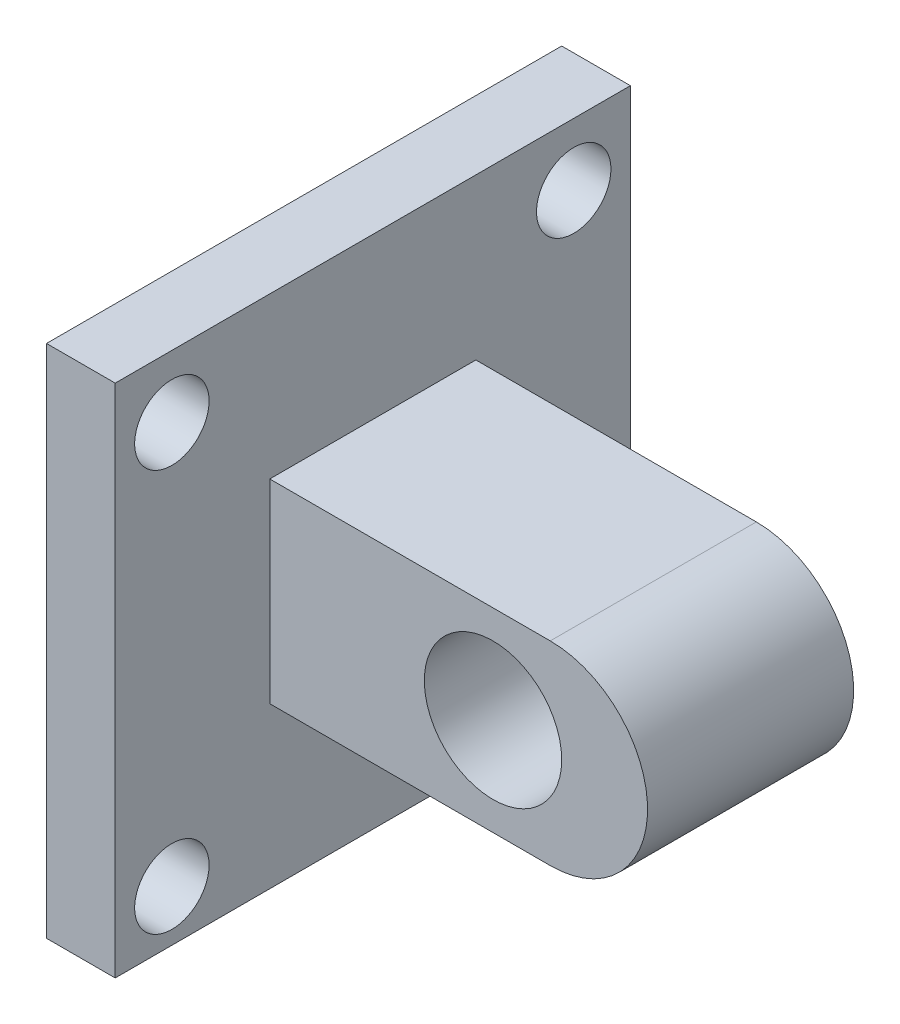
ISO-10303-21;
HEADER;
FILE_DESCRIPTION(('STEP AP214'),'2;1');
FILE_NAME('part.step','',(''),(''),'','','');
FILE_SCHEMA(('AUTOMOTIVE_DESIGN { 1 0 10303 214 1 1 1 1 }'));
ENDSEC;
DATA;
#1=APPLICATION_CONTEXT('core data for automotive mechanical design processes');
#2=APPLICATION_PROTOCOL_DEFINITION('international standard','automotive_design',2000,#1);
#3=PRODUCT_CONTEXT('',#1,'mechanical');
#4=PRODUCT('Part','Part','',(#3));
#5=PRODUCT_RELATED_PRODUCT_CATEGORY('part','',(#4));
#6=PRODUCT_DEFINITION_FORMATION('','',#4);
#7=PRODUCT_DEFINITION_CONTEXT('part definition',#1,'design');
#8=PRODUCT_DEFINITION('design','',#6,#7);
#9=PRODUCT_DEFINITION_SHAPE('','',#8);
#10=(LENGTH_UNIT() NAMED_UNIT(*) SI_UNIT(.MILLI.,.METRE.));
#11=(NAMED_UNIT(*) PLANE_ANGLE_UNIT() SI_UNIT($,.RADIAN.));
#12=(NAMED_UNIT(*) SI_UNIT($,.STERADIAN.) SOLID_ANGLE_UNIT());
#13=UNCERTAINTY_MEASURE_WITH_UNIT(LENGTH_MEASURE(1.E-05),#10,'distance_accuracy_value','');
#14=(GEOMETRIC_REPRESENTATION_CONTEXT(3) GLOBAL_UNCERTAINTY_ASSIGNED_CONTEXT((#13)) GLOBAL_UNIT_ASSIGNED_CONTEXT((#10,
#11,#12)) REPRESENTATION_CONTEXT('',''));
#15=CARTESIAN_POINT('',(0.,0.,0.));
#16=DIRECTION('',(0.,0.,1.));
#17=DIRECTION('',(1.,0.,0.));
#18=AXIS2_PLACEMENT_3D('',#15,#16,#17);
#19=CARTESIAN_POINT('',(-788.553538536997,557.119801279978,-18.));
#20=DIRECTION('',(0.,0.,1.));
#21=DIRECTION('',(1.,0.,0.));
#22=AXIS2_PLACEMENT_3D('',#19,#20,#21);
#23=CYLINDRICAL_SURFACE('',#22,17.);
#24=DIRECTION('',(0.,0.,1.));
#25=VECTOR('',#24,1.);
#26=CARTESIAN_POINT('',(-788.553538536997,574.119801279978,-18.));
#27=LINE('',#26,#25);
#28=CARTESIAN_POINT('',(-788.553538536997,574.119801279978,-18.));
#29=VERTEX_POINT('',#28);
#30=CARTESIAN_POINT('',(-788.553538536997,574.119801279978,18.));
#31=VERTEX_POINT('',#30);
#32=EDGE_CURVE('E52',#29,#31,#27,.T.);
#33=ORIENTED_EDGE('',*,*,#32,.T.);
#34=CARTESIAN_POINT('',(-788.553538536997,557.119801279978,18.));
#35=DIRECTION('',(0.,0.,1.));
#36=DIRECTION('',(1.,0.,0.));
#37=AXIS2_PLACEMENT_3D('',#34,#35,#36);
#38=CIRCLE('',#37,17.);
#39=CARTESIAN_POINT('',(-788.553538536997,540.119801279978,18.));
#40=VERTEX_POINT('',#39);
#41=EDGE_CURVE('E159',#31,#40,#38,.F.);
#42=ORIENTED_EDGE('',*,*,#41,.T.);
#43=DIRECTION('',(0.,0.,1.));
#44=VECTOR('',#43,1.);
#45=CARTESIAN_POINT('',(-788.553538536997,540.119801279978,-18.));
#46=LINE('',#45,#44);
#47=CARTESIAN_POINT('',(-788.553538536997,540.119801279978,-18.));
#48=VERTEX_POINT('',#47);
#49=EDGE_CURVE('E13',#48,#40,#46,.T.);
#50=ORIENTED_EDGE('',*,*,#49,.F.);
#51=CARTESIAN_POINT('',(-788.553538536997,557.119801279978,-18.));
#52=DIRECTION('',(0.,0.,1.));
#53=DIRECTION('',(1.,0.,0.));
#54=AXIS2_PLACEMENT_3D('',#51,#52,#53);
#55=CIRCLE('',#54,17.);
#56=EDGE_CURVE('E176',#29,#48,#55,.F.);
#57=ORIENTED_EDGE('',*,*,#56,.F.);
#58=EDGE_LOOP('',(#33,#42,#50,#57));
#59=FACE_BOUND('',#58,.T.);
#60=ADVANCED_FACE('F49',(#59),#23,.T.);
#61=CARTESIAN_POINT('',(0.,540.119801279978,-18.));
#62=DIRECTION('',(0.,1.,0.));
#63=DIRECTION('',(0.,0.,1.));
#64=AXIS2_PLACEMENT_3D('',#61,#62,#63);
#65=PLANE('',#64);
#66=ORIENTED_EDGE('',*,*,#49,.T.);
#67=DIRECTION('',(-1.,0.,0.));
#68=VECTOR('',#67,1.);
#69=CARTESIAN_POINT('',(0.,540.119801279978,18.));
#70=LINE('',#69,#68);
#71=CARTESIAN_POINT('',(-837.553538536997,540.119801279978,18.));
#72=VERTEX_POINT('',#71);
#73=EDGE_CURVE('E170',#40,#72,#70,.T.);
#74=ORIENTED_EDGE('',*,*,#73,.T.);
#75=DIRECTION('',(0.,0.,1.));
#76=VECTOR('',#75,1.);
#77=CARTESIAN_POINT('',(-837.553538536997,540.119801279978,-18.));
#78=LINE('',#77,#76);
#79=CARTESIAN_POINT('',(-837.553538536997,540.119801279978,-18.));
#80=VERTEX_POINT('',#79);
#81=EDGE_CURVE('E57',#80,#72,#78,.T.);
#82=ORIENTED_EDGE('',*,*,#81,.F.);
#83=DIRECTION('',(-1.,0.,0.));
#84=VECTOR('',#83,1.);
#85=CARTESIAN_POINT('',(0.,540.119801279978,-18.));
#86=LINE('',#85,#84);
#87=EDGE_CURVE('E64',#48,#80,#86,.T.);
#88=ORIENTED_EDGE('',*,*,#87,.F.);
#89=EDGE_LOOP('',(#66,#74,#82,#88));
#90=FACE_BOUND('',#89,.T.);
#91=ADVANCED_FACE('F202',(#90),#65,.F.);
#92=CARTESIAN_POINT('',(0.,574.119801279978,-18.));
#93=DIRECTION('',(0.,-1.,0.));
#94=DIRECTION('',(0.,0.,-1.));
#95=AXIS2_PLACEMENT_3D('',#92,#93,#94);
#96=PLANE('',#95);
#97=DIRECTION('',(0.,0.,1.));
#98=VECTOR('',#97,1.);
#99=CARTESIAN_POINT('',(-837.553538536997,574.119801279978,-18.));
#100=LINE('',#99,#98);
#101=CARTESIAN_POINT('',(-837.553538536997,574.119801279978,-18.));
#102=VERTEX_POINT('',#101);
#103=CARTESIAN_POINT('',(-837.553538536997,574.119801279978,18.));
#104=VERTEX_POINT('',#103);
#105=EDGE_CURVE('E72',#102,#104,#100,.T.);
#106=ORIENTED_EDGE('',*,*,#105,.T.);
#107=DIRECTION('',(1.,0.,0.));
#108=VECTOR('',#107,1.);
#109=CARTESIAN_POINT('',(0.,574.119801279978,18.));
#110=LINE('',#109,#108);
#111=EDGE_CURVE('E165',#104,#31,#110,.T.);
#112=ORIENTED_EDGE('',*,*,#111,.T.);
#113=ORIENTED_EDGE('',*,*,#32,.F.);
#114=DIRECTION('',(1.,0.,0.));
#115=VECTOR('',#114,1.);
#116=CARTESIAN_POINT('',(0.,574.119801279978,-18.));
#117=LINE('',#116,#115);
#118=EDGE_CURVE('E178',#102,#29,#117,.T.);
#119=ORIENTED_EDGE('',*,*,#118,.F.);
#120=EDGE_LOOP('',(#106,#112,#113,#119));
#121=FACE_BOUND('',#120,.T.);
#122=ADVANCED_FACE('F199',(#121),#96,.F.);
#123=CARTESIAN_POINT('',(-798.553538536997,557.119801279978,-18.));
#124=DIRECTION('',(0.,0.,1.));
#125=DIRECTION('',(1.,0.,0.));
#126=AXIS2_PLACEMENT_3D('',#123,#124,#125);
#127=CYLINDRICAL_SURFACE('',#126,12.);
#128=CARTESIAN_POINT('',(-798.553538536997,557.119801279978,-18.));
#129=DIRECTION('',(0.,0.,1.));
#130=DIRECTION('',(1.,0.,0.));
#131=AXIS2_PLACEMENT_3D('',#128,#129,#130);
#132=CIRCLE('',#131,12.);
#133=CARTESIAN_POINT('',(-786.553538536997,557.119801279978,-18.));
#134=VERTEX_POINT('',#133);
#135=EDGE_CURVE('E183',#134,#134,#132,.T.);
#136=ORIENTED_EDGE('',*,*,#135,.F.);
#137=EDGE_LOOP('',(#136));
#138=FACE_BOUND('',#137,.T.);
#139=CARTESIAN_POINT('',(-798.553538536997,557.119801279978,18.));
#140=DIRECTION('',(0.,0.,1.));
#141=DIRECTION('',(1.,0.,0.));
#142=AXIS2_PLACEMENT_3D('',#139,#140,#141);
#143=CIRCLE('',#142,12.);
#144=CARTESIAN_POINT('',(-786.553538536997,557.119801279978,18.));
#145=VERTEX_POINT('',#144);
#146=EDGE_CURVE('E173',#145,#145,#143,.T.);
#147=ORIENTED_EDGE('',*,*,#146,.T.);
#148=EDGE_LOOP('',(#147));
#149=FACE_BOUND('',#148,.T.);
#150=ADVANCED_FACE('F201',(#138,#149),#127,.F.);
#151=CARTESIAN_POINT('',(0.,0.,-18.));
#152=DIRECTION('',(0.,0.,1.));
#153=DIRECTION('',(1.,0.,0.));
#154=AXIS2_PLACEMENT_3D('',#151,#152,#153);
#155=PLANE('',#154);
#156=ORIENTED_EDGE('',*,*,#56,.T.);
#157=ORIENTED_EDGE('',*,*,#87,.T.);
#158=DIRECTION('',(0.,1.,0.));
#159=VECTOR('',#158,1.);
#160=CARTESIAN_POINT('',(-837.553538536997,0.,-18.));
#161=LINE('',#160,#159);
#162=EDGE_CURVE('E180',#80,#102,#161,.T.);
#163=ORIENTED_EDGE('',*,*,#162,.T.);
#164=ORIENTED_EDGE('',*,*,#118,.T.);
#165=EDGE_LOOP('',(#156,#157,#163,#164));
#166=FACE_BOUND('',#165,.T.);
#167=ORIENTED_EDGE('',*,*,#135,.T.);
#168=EDGE_LOOP('',(#167));
#169=FACE_BOUND('',#168,.T.);
#170=ADVANCED_FACE('F207',(#166,#169),#155,.F.);
#171=CARTESIAN_POINT('',(0.,0.,18.));
#172=DIRECTION('',(0.,0.,1.));
#173=DIRECTION('',(1.,0.,0.));
#174=AXIS2_PLACEMENT_3D('',#171,#172,#173);
#175=PLANE('',#174);
#176=ORIENTED_EDGE('',*,*,#41,.F.);
#177=ORIENTED_EDGE('',*,*,#111,.F.);
#178=DIRECTION('',(0.,1.,0.));
#179=VECTOR('',#178,1.);
#180=CARTESIAN_POINT('',(-837.553538536997,0.,18.));
#181=LINE('',#180,#179);
#182=EDGE_CURVE('E168',#72,#104,#181,.T.);
#183=ORIENTED_EDGE('',*,*,#182,.F.);
#184=ORIENTED_EDGE('',*,*,#73,.F.);
#185=EDGE_LOOP('',(#176,#177,#183,#184));
#186=FACE_BOUND('',#185,.T.);
#187=ORIENTED_EDGE('',*,*,#146,.F.);
#188=EDGE_LOOP('',(#187));
#189=FACE_BOUND('',#188,.T.);
#190=ADVANCED_FACE('F196',(#186,#189),#175,.T.);
#191=CARTESIAN_POINT('',(-837.553538536997,0.,-45.));
#192=DIRECTION('',(1.,0.,0.));
#193=DIRECTION('',(0.,0.,-1.));
#194=AXIS2_PLACEMENT_3D('',#191,#192,#193);
#195=PLANE('',#194);
#196=CARTESIAN_POINT('',(-837.553538536997,521.01929621659,35.1005050633883));
#197=DIRECTION('',(1.,0.,0.));
#198=DIRECTION('',(0.,0.,-1.));
#199=AXIS2_PLACEMENT_3D('',#196,#197,#198);
#200=CIRCLE('',#199,6.5);
#201=CARTESIAN_POINT('',(-837.553538536997,521.01929621659,28.6005050633883));
#202=VERTEX_POINT('',#201);
#203=EDGE_CURVE('E347',#202,#202,#200,.T.);
#204=ORIENTED_EDGE('',*,*,#203,.F.);
#205=EDGE_LOOP('',(#204));
#206=FACE_BOUND('',#205,.T.);
#207=CARTESIAN_POINT('',(-837.553538536997,521.01929621659,-35.1005050633883));
#208=DIRECTION('',(1.,0.,0.));
#209=DIRECTION('',(0.,0.,-1.));
#210=AXIS2_PLACEMENT_3D('',#207,#208,#209);
#211=CIRCLE('',#210,6.5);
#212=CARTESIAN_POINT('',(-837.553538536997,521.01929621659,-41.6005050633883));
#213=VERTEX_POINT('',#212);
#214=EDGE_CURVE('E349',#213,#213,#211,.T.);
#215=ORIENTED_EDGE('',*,*,#214,.F.);
#216=EDGE_LOOP('',(#215));
#217=FACE_BOUND('',#216,.T.);
#218=CARTESIAN_POINT('',(-837.553538536997,591.220306343366,-35.1005050633883));
#219=DIRECTION('',(1.,0.,0.));
#220=DIRECTION('',(0.,0.,-1.));
#221=AXIS2_PLACEMENT_3D('',#218,#219,#220);
#222=CIRCLE('',#221,6.5);
#223=CARTESIAN_POINT('',(-837.553538536997,591.220306343366,-41.6005050633883));
#224=VERTEX_POINT('',#223);
#225=EDGE_CURVE('E357',#224,#224,#222,.T.);
#226=ORIENTED_EDGE('',*,*,#225,.F.);
#227=EDGE_LOOP('',(#226));
#228=FACE_BOUND('',#227,.T.);
#229=CARTESIAN_POINT('',(-837.553538536997,591.220306343366,35.1005050633883));
#230=DIRECTION('',(1.,0.,0.));
#231=DIRECTION('',(0.,0.,-1.));
#232=AXIS2_PLACEMENT_3D('',#229,#230,#231);
#233=CIRCLE('',#232,6.5);
#234=CARTESIAN_POINT('',(-837.553538536997,591.220306343366,28.6005050633883));
#235=VERTEX_POINT('',#234);
#236=EDGE_CURVE('E143',#235,#235,#233,.T.);
#237=ORIENTED_EDGE('',*,*,#236,.F.);
#238=EDGE_LOOP('',(#237));
#239=FACE_BOUND('',#238,.T.);
#240=ORIENTED_EDGE('',*,*,#162,.F.);
#241=ORIENTED_EDGE('',*,*,#81,.T.);
#242=ORIENTED_EDGE('',*,*,#182,.T.);
#243=ORIENTED_EDGE('',*,*,#105,.F.);
#244=EDGE_LOOP('',(#240,#241,#242,#243));
#245=FACE_BOUND('',#244,.T.);
#246=DIRECTION('',(0.,0.,1.));
#247=VECTOR('',#246,1.);
#248=CARTESIAN_POINT('',(-837.553538536997,602.119801279978,-45.));
#249=LINE('',#248,#247);
#250=CARTESIAN_POINT('',(-837.553538536997,602.119801279978,-45.));
#251=VERTEX_POINT('',#250);
#252=CARTESIAN_POINT('',(-837.553538536997,602.119801279978,45.));
#253=VERTEX_POINT('',#252);
#254=EDGE_CURVE('E115',#251,#253,#249,.T.);
#255=ORIENTED_EDGE('',*,*,#254,.T.);
#256=DIRECTION('',(0.,1.,0.));
#257=VECTOR('',#256,1.);
#258=CARTESIAN_POINT('',(-837.553538536997,0.,45.));
#259=LINE('',#258,#257);
#260=CARTESIAN_POINT('',(-837.553538536997,512.119801279978,45.));
#261=VERTEX_POINT('',#260);
#262=EDGE_CURVE('E119',#261,#253,#259,.T.);
#263=ORIENTED_EDGE('',*,*,#262,.F.);
#264=DIRECTION('',(0.,0.,1.));
#265=VECTOR('',#264,1.);
#266=CARTESIAN_POINT('',(-837.553538536997,512.119801279978,-45.));
#267=LINE('',#266,#265);
#268=CARTESIAN_POINT('',(-837.553538536997,512.119801279978,-45.));
#269=VERTEX_POINT('',#268);
#270=EDGE_CURVE('E157',#269,#261,#267,.T.);
#271=ORIENTED_EDGE('',*,*,#270,.F.);
#272=DIRECTION('',(0.,1.,0.));
#273=VECTOR('',#272,1.);
#274=CARTESIAN_POINT('',(-837.553538536997,0.,-45.));
#275=LINE('',#274,#273);
#276=EDGE_CURVE('E121',#269,#251,#275,.T.);
#277=ORIENTED_EDGE('',*,*,#276,.T.);
#278=EDGE_LOOP('',(#255,#263,#271,#277));
#279=FACE_BOUND('',#278,.T.);
#280=ADVANCED_FACE('F117',(#206,#217,#228,#239,#245,#279),#195,.T.);
#281=CARTESIAN_POINT('',(0.,512.119801279978,-45.));
#282=DIRECTION('',(0.,-1.,0.));
#283=DIRECTION('',(0.,0.,-1.));
#284=AXIS2_PLACEMENT_3D('',#281,#282,#283);
#285=PLANE('',#284);
#286=ORIENTED_EDGE('',*,*,#270,.T.);
#287=DIRECTION('',(1.,0.,0.));
#288=VECTOR('',#287,1.);
#289=CARTESIAN_POINT('',(0.,512.119801279978,45.));
#290=LINE('',#289,#288);
#291=CARTESIAN_POINT('',(-849.553538536997,512.119801279978,45.));
#292=VERTEX_POINT('',#291);
#293=EDGE_CURVE('E139',#292,#261,#290,.T.);
#294=ORIENTED_EDGE('',*,*,#293,.F.);
#295=DIRECTION('',(0.,0.,1.));
#296=VECTOR('',#295,1.);
#297=CARTESIAN_POINT('',(-849.553538536997,512.119801279978,-45.));
#298=LINE('',#297,#296);
#299=CARTESIAN_POINT('',(-849.553538536997,512.119801279978,-45.));
#300=VERTEX_POINT('',#299);
#301=EDGE_CURVE('E160',#300,#292,#298,.T.);
#302=ORIENTED_EDGE('',*,*,#301,.F.);
#303=DIRECTION('',(1.,0.,0.));
#304=VECTOR('',#303,1.);
#305=CARTESIAN_POINT('',(0.,512.119801279978,-45.));
#306=LINE('',#305,#304);
#307=EDGE_CURVE('E126',#300,#269,#306,.T.);
#308=ORIENTED_EDGE('',*,*,#307,.T.);
#309=EDGE_LOOP('',(#286,#294,#302,#308));
#310=FACE_BOUND('',#309,.T.);
#311=ADVANCED_FACE('F249',(#310),#285,.T.);
#312=CARTESIAN_POINT('',(-849.553538536997,0.,-45.));
#313=DIRECTION('',(-1.,0.,0.));
#314=DIRECTION('',(0.,0.,1.));
#315=AXIS2_PLACEMENT_3D('',#312,#313,#314);
#316=PLANE('',#315);
#317=CARTESIAN_POINT('',(-849.553538536997,521.01929621659,35.1005050633883));
#318=DIRECTION('',(1.,0.,0.));
#319=DIRECTION('',(0.,0.,-1.));
#320=AXIS2_PLACEMENT_3D('',#317,#318,#319);
#321=CIRCLE('',#320,6.5);
#322=CARTESIAN_POINT('',(-849.553538536997,521.01929621659,28.6005050633883));
#323=VERTEX_POINT('',#322);
#324=EDGE_CURVE('E344',#323,#323,#321,.T.);
#325=ORIENTED_EDGE('',*,*,#324,.T.);
#326=EDGE_LOOP('',(#325));
#327=FACE_BOUND('',#326,.T.);
#328=CARTESIAN_POINT('',(-849.553538536997,521.01929621659,-35.1005050633883));
#329=DIRECTION('',(1.,0.,0.));
#330=DIRECTION('',(0.,0.,-1.));
#331=AXIS2_PLACEMENT_3D('',#328,#329,#330);
#332=CIRCLE('',#331,6.5);
#333=CARTESIAN_POINT('',(-849.553538536997,521.01929621659,-41.6005050633883));
#334=VERTEX_POINT('',#333);
#335=EDGE_CURVE('E354',#334,#334,#332,.T.);
#336=ORIENTED_EDGE('',*,*,#335,.T.);
#337=EDGE_LOOP('',(#336));
#338=FACE_BOUND('',#337,.T.);
#339=CARTESIAN_POINT('',(-849.553538536997,591.220306343366,-35.1005050633883));
#340=DIRECTION('',(1.,0.,0.));
#341=DIRECTION('',(0.,0.,-1.));
#342=AXIS2_PLACEMENT_3D('',#339,#340,#341);
#343=CIRCLE('',#342,6.5);
#344=CARTESIAN_POINT('',(-849.553538536997,591.220306343366,-41.6005050633883));
#345=VERTEX_POINT('',#344);
#346=EDGE_CURVE('E360',#345,#345,#343,.T.);
#347=ORIENTED_EDGE('',*,*,#346,.T.);
#348=EDGE_LOOP('',(#347));
#349=FACE_BOUND('',#348,.T.);
#350=CARTESIAN_POINT('',(-849.553538536997,591.220306343366,35.1005050633883));
#351=DIRECTION('',(1.,0.,0.));
#352=DIRECTION('',(0.,0.,-1.));
#353=AXIS2_PLACEMENT_3D('',#350,#351,#352);
#354=CIRCLE('',#353,6.5);
#355=CARTESIAN_POINT('',(-849.553538536997,591.220306343366,28.6005050633883));
#356=VERTEX_POINT('',#355);
#357=EDGE_CURVE('E140',#356,#356,#354,.T.);
#358=ORIENTED_EDGE('',*,*,#357,.T.);
#359=EDGE_LOOP('',(#358));
#360=FACE_BOUND('',#359,.T.);
#361=ORIENTED_EDGE('',*,*,#301,.T.);
#362=DIRECTION('',(0.,-1.,0.));
#363=VECTOR('',#362,1.);
#364=CARTESIAN_POINT('',(-849.553538536997,0.,45.));
#365=LINE('',#364,#363);
#366=CARTESIAN_POINT('',(-849.553538536997,602.119801279978,45.));
#367=VERTEX_POINT('',#366);
#368=EDGE_CURVE('E134',#367,#292,#365,.T.);
#369=ORIENTED_EDGE('',*,*,#368,.F.);
#370=DIRECTION('',(0.,0.,1.));
#371=VECTOR('',#370,1.);
#372=CARTESIAN_POINT('',(-849.553538536997,602.119801279978,-45.));
#373=LINE('',#372,#371);
#374=CARTESIAN_POINT('',(-849.553538536997,602.119801279978,-45.));
#375=VERTEX_POINT('',#374);
#376=EDGE_CURVE('E125',#375,#367,#373,.T.);
#377=ORIENTED_EDGE('',*,*,#376,.F.);
#378=DIRECTION('',(0.,-1.,0.));
#379=VECTOR('',#378,1.);
#380=CARTESIAN_POINT('',(-849.553538536997,0.,-45.));
#381=LINE('',#380,#379);
#382=EDGE_CURVE('E152',#375,#300,#381,.T.);
#383=ORIENTED_EDGE('',*,*,#382,.T.);
#384=EDGE_LOOP('',(#361,#369,#377,#383));
#385=FACE_BOUND('',#384,.T.);
#386=ADVANCED_FACE('F254',(#327,#338,#349,#360,#385),#316,.T.);
#387=CARTESIAN_POINT('',(0.,602.119801279978,-45.));
#388=DIRECTION('',(0.,1.,0.));
#389=DIRECTION('',(0.,0.,1.));
#390=AXIS2_PLACEMENT_3D('',#387,#388,#389);
#391=PLANE('',#390);
#392=ORIENTED_EDGE('',*,*,#376,.T.);
#393=DIRECTION('',(-1.,0.,0.));
#394=VECTOR('',#393,1.);
#395=CARTESIAN_POINT('',(0.,602.119801279978,45.));
#396=LINE('',#395,#394);
#397=EDGE_CURVE('E129',#253,#367,#396,.T.);
#398=ORIENTED_EDGE('',*,*,#397,.F.);
#399=ORIENTED_EDGE('',*,*,#254,.F.);
#400=DIRECTION('',(-1.,0.,0.));
#401=VECTOR('',#400,1.);
#402=CARTESIAN_POINT('',(0.,602.119801279978,-45.));
#403=LINE('',#402,#401);
#404=EDGE_CURVE('E150',#251,#375,#403,.T.);
#405=ORIENTED_EDGE('',*,*,#404,.T.);
#406=EDGE_LOOP('',(#392,#398,#399,#405));
#407=FACE_BOUND('',#406,.T.);
#408=ADVANCED_FACE('F130',(#407),#391,.T.);
#409=CARTESIAN_POINT('',(0.,0.,-45.));
#410=DIRECTION('',(0.,0.,1.));
#411=DIRECTION('',(1.,0.,0.));
#412=AXIS2_PLACEMENT_3D('',#409,#410,#411);
#413=PLANE('',#412);
#414=ORIENTED_EDGE('',*,*,#276,.F.);
#415=ORIENTED_EDGE('',*,*,#307,.F.);
#416=ORIENTED_EDGE('',*,*,#382,.F.);
#417=ORIENTED_EDGE('',*,*,#404,.F.);
#418=EDGE_LOOP('',(#414,#415,#416,#417));
#419=FACE_BOUND('',#418,.T.);
#420=ADVANCED_FACE('F266',(#419),#413,.F.);
#421=CARTESIAN_POINT('',(0.,0.,45.));
#422=DIRECTION('',(0.,0.,1.));
#423=DIRECTION('',(1.,0.,0.));
#424=AXIS2_PLACEMENT_3D('',#421,#422,#423);
#425=PLANE('',#424);
#426=ORIENTED_EDGE('',*,*,#262,.T.);
#427=ORIENTED_EDGE('',*,*,#397,.T.);
#428=ORIENTED_EDGE('',*,*,#368,.T.);
#429=ORIENTED_EDGE('',*,*,#293,.T.);
#430=EDGE_LOOP('',(#426,#427,#428,#429));
#431=FACE_BOUND('',#430,.T.);
#432=ADVANCED_FACE('F137',(#431),#425,.T.);
#433=CARTESIAN_POINT('',(-849.553538536997,591.220306343366,35.1005050633883));
#434=DIRECTION('',(1.,0.,0.));
#435=DIRECTION('',(0.,0.,-1.));
#436=AXIS2_PLACEMENT_3D('',#433,#434,#435);
#437=CYLINDRICAL_SURFACE('',#436,6.5);
#438=ORIENTED_EDGE('',*,*,#357,.F.);
#439=EDGE_LOOP('',(#438));
#440=FACE_BOUND('',#439,.T.);
#441=ORIENTED_EDGE('',*,*,#236,.T.);
#442=EDGE_LOOP('',(#441));
#443=FACE_BOUND('',#442,.T.);
#444=ADVANCED_FACE('F284',(#440,#443),#437,.F.);
#445=CARTESIAN_POINT('',(-849.553538536997,591.220306343366,-35.1005050633883));
#446=DIRECTION('',(1.,0.,0.));
#447=DIRECTION('',(0.,0.,-1.));
#448=AXIS2_PLACEMENT_3D('',#445,#446,#447);
#449=CYLINDRICAL_SURFACE('',#448,6.5);
#450=ORIENTED_EDGE('',*,*,#346,.F.);
#451=EDGE_LOOP('',(#450));
#452=FACE_BOUND('',#451,.T.);
#453=ORIENTED_EDGE('',*,*,#225,.T.);
#454=EDGE_LOOP('',(#453));
#455=FACE_BOUND('',#454,.T.);
#456=ADVANCED_FACE('F307',(#452,#455),#449,.F.);
#457=CARTESIAN_POINT('',(-849.553538536997,521.01929621659,-35.1005050633883));
#458=DIRECTION('',(1.,0.,0.));
#459=DIRECTION('',(0.,0.,-1.));
#460=AXIS2_PLACEMENT_3D('',#457,#458,#459);
#461=CYLINDRICAL_SURFACE('',#460,6.5);
#462=ORIENTED_EDGE('',*,*,#335,.F.);
#463=EDGE_LOOP('',(#462));
#464=FACE_BOUND('',#463,.T.);
#465=ORIENTED_EDGE('',*,*,#214,.T.);
#466=EDGE_LOOP('',(#465));
#467=FACE_BOUND('',#466,.T.);
#468=ADVANCED_FACE('F317',(#464,#467),#461,.F.);
#469=CARTESIAN_POINT('',(-849.553538536997,521.01929621659,35.1005050633883));
#470=DIRECTION('',(1.,0.,0.));
#471=DIRECTION('',(0.,0.,-1.));
#472=AXIS2_PLACEMENT_3D('',#469,#470,#471);
#473=CYLINDRICAL_SURFACE('',#472,6.5);
#474=ORIENTED_EDGE('',*,*,#324,.F.);
#475=EDGE_LOOP('',(#474));
#476=FACE_BOUND('',#475,.T.);
#477=ORIENTED_EDGE('',*,*,#203,.T.);
#478=EDGE_LOOP('',(#477));
#479=FACE_BOUND('',#478,.T.);
#480=ADVANCED_FACE('F327',(#476,#479),#473,.F.);
#481=CLOSED_SHELL('',(#60,#91,#122,#150,#170,#190,#280,#311,#386,#408,#420,#432,#444,#456,#468,#480));
#482=MANIFOLD_SOLID_BREP('B2',#481);
#483=ADVANCED_BREP_SHAPE_REPRESENTATION('',(#18,#482),#14);
#484=SHAPE_DEFINITION_REPRESENTATION(#9,#483);
ENDSEC;
END-ISO-10303-21;
